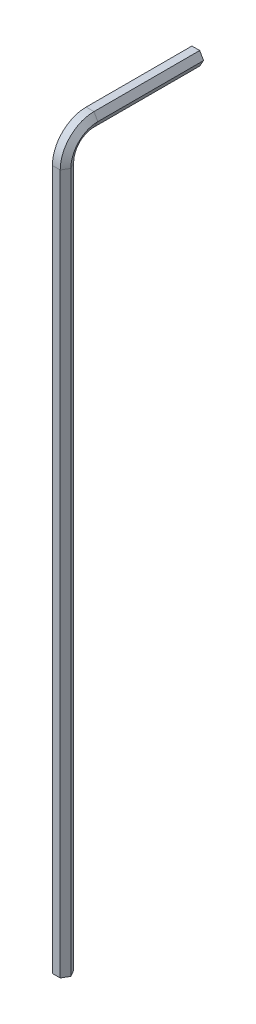
ISO-10303-21;
HEADER;
FILE_DESCRIPTION(('STEP AP214'),'2;1');
FILE_NAME('part.step','',(''),(''),'','','');
FILE_SCHEMA(('AUTOMOTIVE_DESIGN { 1 0 10303 214 1 1 1 1 }'));
ENDSEC;
DATA;
#1=APPLICATION_CONTEXT('core data for automotive mechanical design processes');
#2=APPLICATION_PROTOCOL_DEFINITION('international standard','automotive_design',2000,#1);
#3=PRODUCT_CONTEXT('',#1,'mechanical');
#4=PRODUCT('Part','Part','',(#3));
#5=PRODUCT_RELATED_PRODUCT_CATEGORY('part','',(#4));
#6=PRODUCT_DEFINITION_FORMATION('','',#4);
#7=PRODUCT_DEFINITION_CONTEXT('part definition',#1,'design');
#8=PRODUCT_DEFINITION('design','',#6,#7);
#9=PRODUCT_DEFINITION_SHAPE('','',#8);
#10=(LENGTH_UNIT() NAMED_UNIT(*) SI_UNIT(.MILLI.,.METRE.));
#11=(NAMED_UNIT(*) PLANE_ANGLE_UNIT() SI_UNIT($,.RADIAN.));
#12=(NAMED_UNIT(*) SI_UNIT($,.STERADIAN.) SOLID_ANGLE_UNIT());
#13=UNCERTAINTY_MEASURE_WITH_UNIT(LENGTH_MEASURE(1.E-05),#10,'distance_accuracy_value','');
#14=(GEOMETRIC_REPRESENTATION_CONTEXT(3) GLOBAL_UNCERTAINTY_ASSIGNED_CONTEXT((#13)) GLOBAL_UNIT_ASSIGNED_CONTEXT((#10,
#11,#12)) REPRESENTATION_CONTEXT('',''));
#15=CARTESIAN_POINT('',(0.,0.,0.));
#16=DIRECTION('',(0.,0.,1.));
#17=DIRECTION('',(1.,0.,0.));
#18=AXIS2_PLACEMENT_3D('',#15,#16,#17);
#19=CARTESIAN_POINT('',(0.866025403784435,80.75,-3.));
#20=DIRECTION('',(0.866025403784438,-0.500000000000001,0.));
#21=DIRECTION('',(0.500000000000001,0.866025403784438,0.));
#22=AXIS2_PLACEMENT_3D('',#19,#20,#21);
#23=PLANE('',#22);
#24=DIRECTION('',(-0.500000000000001,-0.866025403784438,0.));
#25=VECTOR('',#24,1.);
#26=CARTESIAN_POINT('',(0.866025403784435,80.75,-3.));
#27=LINE('',#26,#25);
#28=CARTESIAN_POINT('',(0.866025403784435,80.75,-3.));
#29=VERTEX_POINT('',#28);
#30=CARTESIAN_POINT('',(0.433012701892216,80.,-3.));
#31=VERTEX_POINT('',#30);
#32=EDGE_CURVE('E131',#29,#31,#27,.T.);
#33=ORIENTED_EDGE('',*,*,#32,.T.);
#34=DIRECTION('',(0.,0.,-1.));
#35=VECTOR('',#34,1.);
#36=CARTESIAN_POINT('',(0.433012701892216,80.,-3.));
#37=LINE('',#36,#35);
#38=CARTESIAN_POINT('',(0.433012701892216,80.,-14.75));
#39=VERTEX_POINT('',#38);
#40=EDGE_CURVE('E40',#31,#39,#37,.T.);
#41=ORIENTED_EDGE('',*,*,#40,.T.);
#42=DIRECTION('',(-0.500000000000001,-0.866025403784438,0.));
#43=VECTOR('',#42,1.);
#44=CARTESIAN_POINT('',(0.866025403784435,80.75,-14.75));
#45=LINE('',#44,#43);
#46=CARTESIAN_POINT('',(0.866025403784435,80.75,-14.75));
#47=VERTEX_POINT('',#46);
#48=EDGE_CURVE('E47',#47,#39,#45,.T.);
#49=ORIENTED_EDGE('',*,*,#48,.F.);
#50=DIRECTION('',(0.,0.,-1.));
#51=VECTOR('',#50,1.);
#52=CARTESIAN_POINT('',(0.866025403784435,80.75,-3.));
#53=LINE('',#52,#51);
#54=EDGE_CURVE('E11',#29,#47,#53,.T.);
#55=ORIENTED_EDGE('',*,*,#54,.F.);
#56=EDGE_LOOP('',(#33,#41,#49,#55));
#57=FACE_BOUND('',#56,.T.);
#58=ADVANCED_FACE('F33',(#57),#23,.T.);
#59=CARTESIAN_POINT('',(0.433012701892216,80.,-3.));
#60=DIRECTION('',(0.,-1.,0.));
#61=DIRECTION('',(1.,0.,0.));
#62=AXIS2_PLACEMENT_3D('',#59,#60,#61);
#63=PLANE('',#62);
#64=DIRECTION('',(-1.,0.,0.));
#65=VECTOR('',#64,1.);
#66=CARTESIAN_POINT('',(0.433012701892216,80.,-3.));
#67=LINE('',#66,#65);
#68=CARTESIAN_POINT('',(-0.433012701892221,80.,-3.));
#69=VERTEX_POINT('',#68);
#70=EDGE_CURVE('E178',#31,#69,#67,.T.);
#71=ORIENTED_EDGE('',*,*,#70,.T.);
#72=DIRECTION('',(0.,0.,-1.));
#73=VECTOR('',#72,1.);
#74=CARTESIAN_POINT('',(-0.433012701892221,80.,-3.));
#75=LINE('',#74,#73);
#76=CARTESIAN_POINT('',(-0.433012701892221,80.,-14.75));
#77=VERTEX_POINT('',#76);
#78=EDGE_CURVE('E214',#69,#77,#75,.T.);
#79=ORIENTED_EDGE('',*,*,#78,.T.);
#80=DIRECTION('',(-1.,0.,0.));
#81=VECTOR('',#80,1.);
#82=CARTESIAN_POINT('',(0.433012701892216,80.,-14.75));
#83=LINE('',#82,#81);
#84=EDGE_CURVE('E55',#39,#77,#83,.T.);
#85=ORIENTED_EDGE('',*,*,#84,.F.);
#86=ORIENTED_EDGE('',*,*,#40,.F.);
#87=EDGE_LOOP('',(#71,#79,#85,#86));
#88=FACE_BOUND('',#87,.T.);
#89=ADVANCED_FACE('F216',(#88),#63,.T.);
#90=CARTESIAN_POINT('',(-0.433012701892221,80.,-3.));
#91=DIRECTION('',(-0.866025403784441,-0.499999999999995,0.));
#92=DIRECTION('',(0.499999999999995,-0.866025403784442,0.));
#93=AXIS2_PLACEMENT_3D('',#90,#91,#92);
#94=PLANE('',#93);
#95=DIRECTION('',(-0.499999999999995,0.866025403784442,0.));
#96=VECTOR('',#95,1.);
#97=CARTESIAN_POINT('',(-0.433012701892221,80.,-3.));
#98=LINE('',#97,#96);
#99=CARTESIAN_POINT('',(-0.866025403784435,80.75,-3.));
#100=VERTEX_POINT('',#99);
#101=EDGE_CURVE('E175',#69,#100,#98,.T.);
#102=ORIENTED_EDGE('',*,*,#101,.T.);
#103=DIRECTION('',(0.,0.,-1.));
#104=VECTOR('',#103,1.);
#105=CARTESIAN_POINT('',(-0.866025403784435,80.75,-3.));
#106=LINE('',#105,#104);
#107=CARTESIAN_POINT('',(-0.866025403784435,80.75,-14.75));
#108=VERTEX_POINT('',#107);
#109=EDGE_CURVE('E211',#100,#108,#106,.T.);
#110=ORIENTED_EDGE('',*,*,#109,.T.);
#111=DIRECTION('',(-0.499999999999995,0.866025403784442,0.));
#112=VECTOR('',#111,1.);
#113=CARTESIAN_POINT('',(-0.433012701892221,80.,-14.75));
#114=LINE('',#113,#112);
#115=EDGE_CURVE('E200',#77,#108,#114,.T.);
#116=ORIENTED_EDGE('',*,*,#115,.F.);
#117=ORIENTED_EDGE('',*,*,#78,.F.);
#118=EDGE_LOOP('',(#102,#110,#116,#117));
#119=FACE_BOUND('',#118,.T.);
#120=ADVANCED_FACE('F281',(#119),#94,.T.);
#121=CARTESIAN_POINT('',(-0.866025403784435,80.75,-3.));
#122=DIRECTION('',(-0.866025403784434,0.500000000000007,0.));
#123=DIRECTION('',(-0.500000000000007,-0.866025403784435,0.));
#124=AXIS2_PLACEMENT_3D('',#121,#122,#123);
#125=PLANE('',#124);
#126=DIRECTION('',(0.500000000000007,0.866025403784435,0.));
#127=VECTOR('',#126,1.);
#128=CARTESIAN_POINT('',(-0.866025403784435,80.75,-3.));
#129=LINE('',#128,#127);
#130=CARTESIAN_POINT('',(-0.433012701892211,81.5,-3.));
#131=VERTEX_POINT('',#130);
#132=EDGE_CURVE('E172',#100,#131,#129,.T.);
#133=ORIENTED_EDGE('',*,*,#132,.T.);
#134=DIRECTION('',(0.,0.,-1.));
#135=VECTOR('',#134,1.);
#136=CARTESIAN_POINT('',(-0.433012701892211,81.5,-3.));
#137=LINE('',#136,#135);
#138=CARTESIAN_POINT('',(-0.433012701892211,81.5,-14.75));
#139=VERTEX_POINT('',#138);
#140=EDGE_CURVE('E208',#131,#139,#137,.T.);
#141=ORIENTED_EDGE('',*,*,#140,.T.);
#142=DIRECTION('',(0.500000000000007,0.866025403784435,0.));
#143=VECTOR('',#142,1.);
#144=CARTESIAN_POINT('',(-0.866025403784435,80.75,-14.75));
#145=LINE('',#144,#143);
#146=EDGE_CURVE('E197',#108,#139,#145,.T.);
#147=ORIENTED_EDGE('',*,*,#146,.F.);
#148=ORIENTED_EDGE('',*,*,#109,.F.);
#149=EDGE_LOOP('',(#133,#141,#147,#148));
#150=FACE_BOUND('',#149,.T.);
#151=ADVANCED_FACE('F280',(#150),#125,.T.);
#152=CARTESIAN_POINT('',(-0.433012701892211,81.5,-3.));
#153=DIRECTION('',(0.,1.,0.));
#154=DIRECTION('',(-1.,0.,0.));
#155=AXIS2_PLACEMENT_3D('',#152,#153,#154);
#156=PLANE('',#155);
#157=DIRECTION('',(1.,0.,0.));
#158=VECTOR('',#157,1.);
#159=CARTESIAN_POINT('',(-0.433012701892211,81.5,-3.));
#160=LINE('',#159,#158);
#161=CARTESIAN_POINT('',(0.433012701892226,81.5,-3.));
#162=VERTEX_POINT('',#161);
#163=EDGE_CURVE('E164',#131,#162,#160,.T.);
#164=ORIENTED_EDGE('',*,*,#163,.T.);
#165=DIRECTION('',(0.,0.,-1.));
#166=VECTOR('',#165,1.);
#167=CARTESIAN_POINT('',(0.433012701892226,81.5,-3.));
#168=LINE('',#167,#166);
#169=CARTESIAN_POINT('',(0.433012701892226,81.5,-14.75));
#170=VERTEX_POINT('',#169);
#171=EDGE_CURVE('E205',#162,#170,#168,.T.);
#172=ORIENTED_EDGE('',*,*,#171,.T.);
#173=DIRECTION('',(1.,0.,0.));
#174=VECTOR('',#173,1.);
#175=CARTESIAN_POINT('',(-0.433012701892211,81.5,-14.75));
#176=LINE('',#175,#174);
#177=EDGE_CURVE('E194',#139,#170,#176,.T.);
#178=ORIENTED_EDGE('',*,*,#177,.F.);
#179=ORIENTED_EDGE('',*,*,#140,.F.);
#180=EDGE_LOOP('',(#164,#172,#178,#179));
#181=FACE_BOUND('',#180,.T.);
#182=ADVANCED_FACE('F287',(#181),#156,.T.);
#183=CARTESIAN_POINT('',(0.433012701892226,81.5,-3.));
#184=DIRECTION('',(0.866025403784442,0.499999999999995,0.));
#185=DIRECTION('',(-0.499999999999995,0.866025403784442,0.));
#186=AXIS2_PLACEMENT_3D('',#183,#184,#185);
#187=PLANE('',#186);
#188=DIRECTION('',(0.499999999999995,-0.866025403784442,0.));
#189=VECTOR('',#188,1.);
#190=CARTESIAN_POINT('',(0.433012701892226,81.5,-3.));
#191=LINE('',#190,#189);
#192=EDGE_CURVE('E161',#162,#29,#191,.T.);
#193=ORIENTED_EDGE('',*,*,#192,.T.);
#194=ORIENTED_EDGE('',*,*,#54,.T.);
#195=DIRECTION('',(0.499999999999995,-0.866025403784442,0.));
#196=VECTOR('',#195,1.);
#197=CARTESIAN_POINT('',(0.433012701892226,81.5,-14.75));
#198=LINE('',#197,#196);
#199=EDGE_CURVE('E134',#170,#47,#198,.T.);
#200=ORIENTED_EDGE('',*,*,#199,.F.);
#201=ORIENTED_EDGE('',*,*,#171,.F.);
#202=EDGE_LOOP('',(#193,#194,#200,#201));
#203=FACE_BOUND('',#202,.T.);
#204=ADVANCED_FACE('F285',(#203),#187,.T.);
#205=CARTESIAN_POINT('',(0.866025403784435,77.75,-3.));
#206=DIRECTION('',(1.,0.,0.));
#207=DIRECTION('',(0.,0.,-1.));
#208=AXIS2_PLACEMENT_3D('',#205,#206,#207);
#209=CONICAL_SURFACE('',#208,3.,1.0471975511966);
#210=DIRECTION('',(-0.500000000000001,0.,-0.866025403784438));
#211=VECTOR('',#210,1.);
#212=CARTESIAN_POINT('',(0.866025403784435,77.75,0.));
#213=LINE('',#212,#211);
#214=CARTESIAN_POINT('',(0.866025403784435,77.75,0.));
#215=VERTEX_POINT('',#214);
#216=CARTESIAN_POINT('',(0.433012701892216,77.75,-0.749999999999998));
#217=VERTEX_POINT('',#216);
#218=EDGE_CURVE('E128',#215,#217,#213,.T.);
#219=ORIENTED_EDGE('',*,*,#218,.T.);
#220=CARTESIAN_POINT('',(0.433012701892216,77.75,-3.));
#221=DIRECTION('',(-1.,0.,0.));
#222=DIRECTION('',(0.,0.,1.));
#223=AXIS2_PLACEMENT_3D('',#220,#221,#222);
#224=CIRCLE('',#223,2.25);
#225=EDGE_CURVE('E135',#217,#31,#224,.T.);
#226=ORIENTED_EDGE('',*,*,#225,.T.);
#227=ORIENTED_EDGE('',*,*,#32,.F.);
#228=CARTESIAN_POINT('',(0.866025403784435,77.75,-3.));
#229=DIRECTION('',(-1.,0.,0.));
#230=DIRECTION('',(0.,0.,1.));
#231=AXIS2_PLACEMENT_3D('',#228,#229,#230);
#232=CIRCLE('',#231,3.);
#233=EDGE_CURVE('E123',#215,#29,#232,.T.);
#234=ORIENTED_EDGE('',*,*,#233,.F.);
#235=EDGE_LOOP('',(#219,#226,#227,#234));
#236=FACE_BOUND('',#235,.T.);
#237=ADVANCED_FACE('F125',(#236),#209,.F.);
#238=CARTESIAN_POINT('',(0.,77.75,-3.));
#239=DIRECTION('',(-1.,0.,0.));
#240=DIRECTION('',(0.,0.,1.));
#241=AXIS2_PLACEMENT_3D('',#238,#239,#240);
#242=CYLINDRICAL_SURFACE('',#241,2.25);
#243=DIRECTION('',(-1.,0.,0.));
#244=VECTOR('',#243,1.);
#245=CARTESIAN_POINT('',(0.433012701892216,77.75,-0.749999999999998));
#246=LINE('',#245,#244);
#247=CARTESIAN_POINT('',(-0.433012701892221,77.75,-0.749999999999995));
#248=VERTEX_POINT('',#247);
#249=EDGE_CURVE('E156',#217,#248,#246,.T.);
#250=ORIENTED_EDGE('',*,*,#249,.T.);
#251=CARTESIAN_POINT('',(-0.433012701892221,77.75,-3.));
#252=DIRECTION('',(-1.,0.,0.));
#253=DIRECTION('',(0.,0.,1.));
#254=AXIS2_PLACEMENT_3D('',#251,#252,#253);
#255=CIRCLE('',#254,2.25000000000001);
#256=EDGE_CURVE('E189',#248,#69,#255,.T.);
#257=ORIENTED_EDGE('',*,*,#256,.T.);
#258=ORIENTED_EDGE('',*,*,#70,.F.);
#259=ORIENTED_EDGE('',*,*,#225,.F.);
#260=EDGE_LOOP('',(#250,#257,#258,#259));
#261=FACE_BOUND('',#260,.T.);
#262=ADVANCED_FACE('F225',(#261),#242,.F.);
#263=CARTESIAN_POINT('',(-0.433012701892221,77.75,-3.));
#264=DIRECTION('',(-1.,0.,0.));
#265=DIRECTION('',(0.,0.,1.));
#266=AXIS2_PLACEMENT_3D('',#263,#264,#265);
#267=CONICAL_SURFACE('',#266,2.25000000000001,1.0471975511966);
#268=DIRECTION('',(-0.499999999999995,0.,0.866025403784442));
#269=VECTOR('',#268,1.);
#270=CARTESIAN_POINT('',(-0.433012701892221,77.75,-0.749999999999995));
#271=LINE('',#270,#269);
#272=CARTESIAN_POINT('',(-0.866025403784435,77.75,0.));
#273=VERTEX_POINT('',#272);
#274=EDGE_CURVE('E228',#248,#273,#271,.T.);
#275=ORIENTED_EDGE('',*,*,#274,.T.);
#276=CARTESIAN_POINT('',(-0.866025403784435,77.75,-3.));
#277=DIRECTION('',(-1.,0.,0.));
#278=DIRECTION('',(0.,0.,1.));
#279=AXIS2_PLACEMENT_3D('',#276,#277,#278);
#280=CIRCLE('',#279,3.00000000000001);
#281=EDGE_CURVE('E186',#273,#100,#280,.T.);
#282=ORIENTED_EDGE('',*,*,#281,.T.);
#283=ORIENTED_EDGE('',*,*,#101,.F.);
#284=ORIENTED_EDGE('',*,*,#256,.F.);
#285=EDGE_LOOP('',(#275,#282,#283,#284));
#286=FACE_BOUND('',#285,.T.);
#287=ADVANCED_FACE('F221',(#286),#267,.F.);
#288=CARTESIAN_POINT('',(-0.866025403784435,77.75,-3.));
#289=DIRECTION('',(1.,0.,0.));
#290=DIRECTION('',(0.,0.,-1.));
#291=AXIS2_PLACEMENT_3D('',#288,#289,#290);
#292=CONICAL_SURFACE('',#291,3.00000000000001,1.04719755119659);
#293=DIRECTION('',(0.500000000000007,0.,0.866025403784435));
#294=VECTOR('',#293,1.);
#295=CARTESIAN_POINT('',(-0.866025403784435,77.75,0.));
#296=LINE('',#295,#294);
#297=CARTESIAN_POINT('',(-0.433012701892211,77.75,0.750000000000001));
#298=VERTEX_POINT('',#297);
#299=EDGE_CURVE('E242',#273,#298,#296,.T.);
#300=ORIENTED_EDGE('',*,*,#299,.T.);
#301=CARTESIAN_POINT('',(-0.433012701892211,77.75,-3.));
#302=DIRECTION('',(-1.,0.,0.));
#303=DIRECTION('',(0.,0.,1.));
#304=AXIS2_PLACEMENT_3D('',#301,#302,#303);
#305=CIRCLE('',#304,3.75);
#306=EDGE_CURVE('E183',#298,#131,#305,.T.);
#307=ORIENTED_EDGE('',*,*,#306,.T.);
#308=ORIENTED_EDGE('',*,*,#132,.F.);
#309=ORIENTED_EDGE('',*,*,#281,.F.);
#310=EDGE_LOOP('',(#300,#307,#308,#309));
#311=FACE_BOUND('',#310,.T.);
#312=ADVANCED_FACE('F278',(#311),#292,.T.);
#313=CARTESIAN_POINT('',(0.,77.75,-3.));
#314=DIRECTION('',(-1.,0.,0.));
#315=DIRECTION('',(0.,0.,1.));
#316=AXIS2_PLACEMENT_3D('',#313,#314,#315);
#317=CYLINDRICAL_SURFACE('',#316,3.75);
#318=DIRECTION('',(1.,0.,0.));
#319=VECTOR('',#318,1.);
#320=CARTESIAN_POINT('',(-0.433012701892211,77.75,0.750000000000001));
#321=LINE('',#320,#319);
#322=CARTESIAN_POINT('',(0.433012701892226,77.75,0.749999999999992));
#323=VERTEX_POINT('',#322);
#324=EDGE_CURVE('E245',#298,#323,#321,.T.);
#325=ORIENTED_EDGE('',*,*,#324,.T.);
#326=CARTESIAN_POINT('',(0.433012701892226,77.75,-3.));
#327=DIRECTION('',(-1.,0.,0.));
#328=DIRECTION('',(0.,0.,1.));
#329=AXIS2_PLACEMENT_3D('',#326,#327,#328);
#330=CIRCLE('',#329,3.74999999999999);
#331=EDGE_CURVE('E141',#323,#162,#330,.T.);
#332=ORIENTED_EDGE('',*,*,#331,.T.);
#333=ORIENTED_EDGE('',*,*,#163,.F.);
#334=ORIENTED_EDGE('',*,*,#306,.F.);
#335=EDGE_LOOP('',(#325,#332,#333,#334));
#336=FACE_BOUND('',#335,.T.);
#337=ADVANCED_FACE('F275',(#336),#317,.T.);
#338=CARTESIAN_POINT('',(0.433012701892226,77.75,-3.));
#339=DIRECTION('',(-1.,0.,0.));
#340=DIRECTION('',(0.,0.,1.));
#341=AXIS2_PLACEMENT_3D('',#338,#339,#340);
#342=CONICAL_SURFACE('',#341,3.74999999999999,1.0471975511966);
#343=DIRECTION('',(0.499999999999995,0.,-0.866025403784442));
#344=VECTOR('',#343,1.);
#345=CARTESIAN_POINT('',(0.433012701892226,77.75,0.749999999999992));
#346=LINE('',#345,#344);
#347=EDGE_CURVE('E138',#323,#215,#346,.T.);
#348=ORIENTED_EDGE('',*,*,#347,.T.);
#349=ORIENTED_EDGE('',*,*,#233,.T.);
#350=ORIENTED_EDGE('',*,*,#192,.F.);
#351=ORIENTED_EDGE('',*,*,#331,.F.);
#352=EDGE_LOOP('',(#348,#349,#350,#351));
#353=FACE_BOUND('',#352,.T.);
#354=ADVANCED_FACE('F139',(#353),#342,.T.);
#355=CARTESIAN_POINT('',(0.433012701892226,77.75,0.749999999999992));
#356=DIRECTION('',(-0.866025403784441,0.,-0.499999999999995));
#357=DIRECTION('',(-0.499999999999995,0.,0.866025403784442));
#358=AXIS2_PLACEMENT_3D('',#355,#356,#357);
#359=PLANE('',#358);
#360=DIRECTION('',(0.499999999999995,0.,-0.866025403784442));
#361=VECTOR('',#360,1.);
#362=CARTESIAN_POINT('',(0.433012701892226,0.,0.749999999999992));
#363=LINE('',#362,#361);
#364=CARTESIAN_POINT('',(0.433012701892226,0.,0.749999999999992));
#365=VERTEX_POINT('',#364);
#366=CARTESIAN_POINT('',(0.866025403784435,0.,0.));
#367=VERTEX_POINT('',#366);
#368=EDGE_CURVE('E160',#365,#367,#363,.T.);
#369=ORIENTED_EDGE('',*,*,#368,.T.);
#370=DIRECTION('',(0.,-1.,0.));
#371=VECTOR('',#370,1.);
#372=CARTESIAN_POINT('',(0.866025403784435,77.75,0.));
#373=LINE('',#372,#371);
#374=EDGE_CURVE('E151',#215,#367,#373,.T.);
#375=ORIENTED_EDGE('',*,*,#374,.F.);
#376=ORIENTED_EDGE('',*,*,#347,.F.);
#377=DIRECTION('',(0.,-1.,0.));
#378=VECTOR('',#377,1.);
#379=CARTESIAN_POINT('',(0.433012701892226,77.75,0.749999999999992));
#380=LINE('',#379,#378);
#381=EDGE_CURVE('E249',#323,#365,#380,.T.);
#382=ORIENTED_EDGE('',*,*,#381,.T.);
#383=EDGE_LOOP('',(#369,#375,#376,#382));
#384=FACE_BOUND('',#383,.T.);
#385=ADVANCED_FACE('F158',(#384),#359,.F.);
#386=CARTESIAN_POINT('',(0.866025403784435,77.75,0.));
#387=DIRECTION('',(-0.866025403784438,0.,0.500000000000001));
#388=DIRECTION('',(0.500000000000001,0.,0.866025403784438));
#389=AXIS2_PLACEMENT_3D('',#386,#387,#388);
#390=PLANE('',#389);
#391=DIRECTION('',(-0.500000000000001,0.,-0.866025403784438));
#392=VECTOR('',#391,1.);
#393=CARTESIAN_POINT('',(0.866025403784435,0.,0.));
#394=LINE('',#393,#392);
#395=CARTESIAN_POINT('',(0.433012701892216,0.,-0.749999999999998));
#396=VERTEX_POINT('',#395);
#397=EDGE_CURVE('E251',#367,#396,#394,.T.);
#398=ORIENTED_EDGE('',*,*,#397,.T.);
#399=DIRECTION('',(0.,-1.,0.));
#400=VECTOR('',#399,1.);
#401=CARTESIAN_POINT('',(0.433012701892216,77.75,-0.749999999999998));
#402=LINE('',#401,#400);
#403=EDGE_CURVE('E154',#217,#396,#402,.T.);
#404=ORIENTED_EDGE('',*,*,#403,.F.);
#405=ORIENTED_EDGE('',*,*,#218,.F.);
#406=ORIENTED_EDGE('',*,*,#374,.T.);
#407=EDGE_LOOP('',(#398,#404,#405,#406));
#408=FACE_BOUND('',#407,.T.);
#409=ADVANCED_FACE('F150',(#408),#390,.F.);
#410=CARTESIAN_POINT('',(0.433012701892216,77.75,-0.749999999999998));
#411=DIRECTION('',(0.,0.,1.));
#412=DIRECTION('',(1.,0.,0.));
#413=AXIS2_PLACEMENT_3D('',#410,#411,#412);
#414=PLANE('',#413);
#415=DIRECTION('',(-1.,0.,0.));
#416=VECTOR('',#415,1.);
#417=CARTESIAN_POINT('',(0.433012701892216,0.,-0.749999999999998));
#418=LINE('',#417,#416);
#419=CARTESIAN_POINT('',(-0.433012701892221,0.,-0.749999999999995));
#420=VERTEX_POINT('',#419);
#421=EDGE_CURVE('E234',#396,#420,#418,.T.);
#422=ORIENTED_EDGE('',*,*,#421,.T.);
#423=DIRECTION('',(0.,-1.,0.));
#424=VECTOR('',#423,1.);
#425=CARTESIAN_POINT('',(-0.433012701892221,77.75,-0.749999999999995));
#426=LINE('',#425,#424);
#427=EDGE_CURVE('E166',#248,#420,#426,.T.);
#428=ORIENTED_EDGE('',*,*,#427,.F.);
#429=ORIENTED_EDGE('',*,*,#249,.F.);
#430=ORIENTED_EDGE('',*,*,#403,.T.);
#431=EDGE_LOOP('',(#422,#428,#429,#430));
#432=FACE_BOUND('',#431,.T.);
#433=ADVANCED_FACE('F232',(#432),#414,.F.);
#434=CARTESIAN_POINT('',(-0.433012701892221,77.75,-0.749999999999995));
#435=DIRECTION('',(0.866025403784441,0.,0.499999999999995));
#436=DIRECTION('',(0.499999999999995,0.,-0.866025403784442));
#437=AXIS2_PLACEMENT_3D('',#434,#435,#436);
#438=PLANE('',#437);
#439=DIRECTION('',(-0.499999999999995,0.,0.866025403784442));
#440=VECTOR('',#439,1.);
#441=CARTESIAN_POINT('',(-0.433012701892221,0.,-0.749999999999995));
#442=LINE('',#441,#440);
#443=CARTESIAN_POINT('',(-0.866025403784435,0.,0.));
#444=VERTEX_POINT('',#443);
#445=EDGE_CURVE('E254',#420,#444,#442,.T.);
#446=ORIENTED_EDGE('',*,*,#445,.T.);
#447=DIRECTION('',(0.,-1.,0.));
#448=VECTOR('',#447,1.);
#449=CARTESIAN_POINT('',(-0.866025403784435,77.75,0.));
#450=LINE('',#449,#448);
#451=EDGE_CURVE('E237',#273,#444,#450,.T.);
#452=ORIENTED_EDGE('',*,*,#451,.F.);
#453=ORIENTED_EDGE('',*,*,#274,.F.);
#454=ORIENTED_EDGE('',*,*,#427,.T.);
#455=EDGE_LOOP('',(#446,#452,#453,#454));
#456=FACE_BOUND('',#455,.T.);
#457=ADVANCED_FACE('F239',(#456),#438,.F.);
#458=CARTESIAN_POINT('',(-0.866025403784435,77.75,0.));
#459=DIRECTION('',(0.866025403784435,0.,-0.500000000000007));
#460=DIRECTION('',(-0.500000000000007,0.,-0.866025403784435));
#461=AXIS2_PLACEMENT_3D('',#458,#459,#460);
#462=PLANE('',#461);
#463=DIRECTION('',(0.500000000000007,0.,0.866025403784435));
#464=VECTOR('',#463,1.);
#465=CARTESIAN_POINT('',(-0.866025403784435,0.,0.));
#466=LINE('',#465,#464);
#467=CARTESIAN_POINT('',(-0.433012701892211,0.,0.750000000000001));
#468=VERTEX_POINT('',#467);
#469=EDGE_CURVE('E256',#444,#468,#466,.T.);
#470=ORIENTED_EDGE('',*,*,#469,.T.);
#471=DIRECTION('',(0.,-1.,0.));
#472=VECTOR('',#471,1.);
#473=CARTESIAN_POINT('',(-0.433012701892211,77.75,0.750000000000001));
#474=LINE('',#473,#472);
#475=EDGE_CURVE('E260',#298,#468,#474,.T.);
#476=ORIENTED_EDGE('',*,*,#475,.F.);
#477=ORIENTED_EDGE('',*,*,#299,.F.);
#478=ORIENTED_EDGE('',*,*,#451,.T.);
#479=EDGE_LOOP('',(#470,#476,#477,#478));
#480=FACE_BOUND('',#479,.T.);
#481=ADVANCED_FACE('F265',(#480),#462,.F.);
#482=CARTESIAN_POINT('',(-0.433012701892211,77.75,0.750000000000001));
#483=DIRECTION('',(0.,0.,-1.));
#484=DIRECTION('',(-1.,0.,0.));
#485=AXIS2_PLACEMENT_3D('',#482,#483,#484);
#486=PLANE('',#485);
#487=DIRECTION('',(1.,0.,0.));
#488=VECTOR('',#487,1.);
#489=CARTESIAN_POINT('',(-0.433012701892211,0.,0.750000000000001));
#490=LINE('',#489,#488);
#491=EDGE_CURVE('E146',#468,#365,#490,.T.);
#492=ORIENTED_EDGE('',*,*,#491,.T.);
#493=ORIENTED_EDGE('',*,*,#381,.F.);
#494=ORIENTED_EDGE('',*,*,#324,.F.);
#495=ORIENTED_EDGE('',*,*,#475,.T.);
#496=EDGE_LOOP('',(#492,#493,#494,#495));
#497=FACE_BOUND('',#496,.T.);
#498=ADVANCED_FACE('F272',(#497),#486,.F.);
#499=CARTESIAN_POINT('',(0.,80.75,-14.75));
#500=DIRECTION('',(0.,0.,-1.));
#501=DIRECTION('',(0.,1.,0.));
#502=AXIS2_PLACEMENT_3D('',#499,#500,#501);
#503=PLANE('',#502);
#504=ORIENTED_EDGE('',*,*,#199,.T.);
#505=ORIENTED_EDGE('',*,*,#48,.T.);
#506=ORIENTED_EDGE('',*,*,#84,.T.);
#507=ORIENTED_EDGE('',*,*,#115,.T.);
#508=ORIENTED_EDGE('',*,*,#146,.T.);
#509=ORIENTED_EDGE('',*,*,#177,.T.);
#510=EDGE_LOOP('',(#504,#505,#506,#507,#508,#509));
#511=FACE_BOUND('',#510,.T.);
#512=ADVANCED_FACE('F283',(#511),#503,.T.);
#513=CARTESIAN_POINT('',(0.,0.,0.));
#514=DIRECTION('',(0.,1.,0.));
#515=DIRECTION('',(0.,0.,1.));
#516=AXIS2_PLACEMENT_3D('',#513,#514,#515);
#517=PLANE('',#516);
#518=ORIENTED_EDGE('',*,*,#368,.F.);
#519=ORIENTED_EDGE('',*,*,#491,.F.);
#520=ORIENTED_EDGE('',*,*,#469,.F.);
#521=ORIENTED_EDGE('',*,*,#445,.F.);
#522=ORIENTED_EDGE('',*,*,#421,.F.);
#523=ORIENTED_EDGE('',*,*,#397,.F.);
#524=EDGE_LOOP('',(#518,#519,#520,#521,#522,#523));
#525=FACE_BOUND('',#524,.T.);
#526=ADVANCED_FACE('F269',(#525),#517,.F.);
#527=CLOSED_SHELL('',(#58,#89,#120,#151,#182,#204,#237,#262,#287,#312,#337,#354,#385,#409,#433,
#457,#481,#498,#512,#526));
#528=MANIFOLD_SOLID_BREP('B2',#527);
#529=ADVANCED_BREP_SHAPE_REPRESENTATION('',(#18,#528),#14);
#530=SHAPE_DEFINITION_REPRESENTATION(#9,#529);
ENDSEC;
END-ISO-10303-21;
